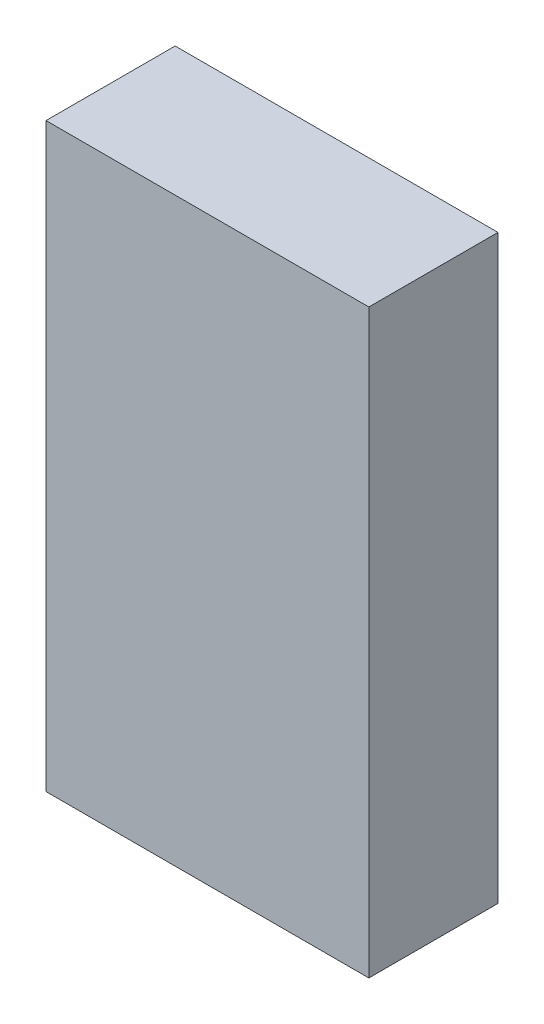
ISO-10303-21;
HEADER;
FILE_DESCRIPTION(('STEP AP214'),'2;1');
FILE_NAME('part.step','',(''),(''),'','','');
FILE_SCHEMA(('AUTOMOTIVE_DESIGN { 1 0 10303 214 1 1 1 1 }'));
ENDSEC;
DATA;
#1=APPLICATION_CONTEXT('core data for automotive mechanical design processes');
#2=APPLICATION_PROTOCOL_DEFINITION('international standard','automotive_design',2000,#1);
#3=PRODUCT_CONTEXT('',#1,'mechanical');
#4=PRODUCT('Part','Part','',(#3));
#5=PRODUCT_RELATED_PRODUCT_CATEGORY('part','',(#4));
#6=PRODUCT_DEFINITION_FORMATION('','',#4);
#7=PRODUCT_DEFINITION_CONTEXT('part definition',#1,'design');
#8=PRODUCT_DEFINITION('design','',#6,#7);
#9=PRODUCT_DEFINITION_SHAPE('','',#8);
#10=(LENGTH_UNIT() NAMED_UNIT(*) SI_UNIT(.MILLI.,.METRE.));
#11=(NAMED_UNIT(*) PLANE_ANGLE_UNIT() SI_UNIT($,.RADIAN.));
#12=(NAMED_UNIT(*) SI_UNIT($,.STERADIAN.) SOLID_ANGLE_UNIT());
#13=UNCERTAINTY_MEASURE_WITH_UNIT(LENGTH_MEASURE(1.E-05),#10,'distance_accuracy_value','');
#14=(GEOMETRIC_REPRESENTATION_CONTEXT(3) GLOBAL_UNCERTAINTY_ASSIGNED_CONTEXT((#13)) GLOBAL_UNIT_ASSIGNED_CONTEXT((#10,
#11,#12)) REPRESENTATION_CONTEXT('',''));
#15=CARTESIAN_POINT('',(0.,0.,0.));
#16=DIRECTION('',(0.,0.,1.));
#17=DIRECTION('',(1.,0.,0.));
#18=AXIS2_PLACEMENT_3D('',#15,#16,#17);
#19=CARTESIAN_POINT('',(0.875,-2.05,0.));
#20=DIRECTION('',(1.,0.,0.));
#21=DIRECTION('',(0.,0.,1.));
#22=AXIS2_PLACEMENT_3D('',#19,#20,#21);
#23=PLANE('',#22);
#24=DIRECTION('',(0.,1.,0.));
#25=VECTOR('',#24,1.);
#26=CARTESIAN_POINT('',(0.875,-2.05,0.1));
#27=LINE('',#26,#25);
#28=CARTESIAN_POINT('',(0.875,-2.05,0.1));
#29=VERTEX_POINT('',#28);
#30=CARTESIAN_POINT('',(0.875,-1.6,0.1));
#31=VERTEX_POINT('',#30);
#32=EDGE_CURVE('E11',#29,#31,#27,.T.);
#33=ORIENTED_EDGE('',*,*,#32,.T.);
#34=DIRECTION('',(0.,0.,1.));
#35=VECTOR('',#34,1.);
#36=CARTESIAN_POINT('',(0.875,-1.6,0.));
#37=LINE('',#36,#35);
#38=CARTESIAN_POINT('',(0.875,-1.6,0.));
#39=VERTEX_POINT('',#38);
#40=EDGE_CURVE('E24',#39,#31,#37,.T.);
#41=ORIENTED_EDGE('',*,*,#40,.F.);
#42=DIRECTION('',(0.,1.,0.));
#43=VECTOR('',#42,1.);
#44=CARTESIAN_POINT('',(0.875,-2.05,0.));
#45=LINE('',#44,#43);
#46=CARTESIAN_POINT('',(0.875,-2.05,0.));
#47=VERTEX_POINT('',#46);
#48=EDGE_CURVE('E86',#47,#39,#45,.T.);
#49=ORIENTED_EDGE('',*,*,#48,.F.);
#50=DIRECTION('',(0.,0.,1.));
#51=VECTOR('',#50,1.);
#52=CARTESIAN_POINT('',(0.875,-2.05,0.));
#53=LINE('',#52,#51);
#54=EDGE_CURVE('E36',#47,#29,#53,.T.);
#55=ORIENTED_EDGE('',*,*,#54,.T.);
#56=EDGE_LOOP('',(#33,#41,#49,#55));
#57=FACE_BOUND('',#56,.T.);
#58=ADVANCED_FACE('F17',(#57),#23,.F.);
#59=CARTESIAN_POINT('',(1.125,-2.05,0.));
#60=DIRECTION('',(1.,0.,0.));
#61=DIRECTION('',(0.,0.,1.));
#62=AXIS2_PLACEMENT_3D('',#59,#60,#61);
#63=PLANE('',#62);
#64=DIRECTION('',(0.,0.,1.));
#65=VECTOR('',#64,1.);
#66=CARTESIAN_POINT('',(1.125,-2.05,0.));
#67=LINE('',#66,#65);
#68=CARTESIAN_POINT('',(1.125,-2.05,0.));
#69=VERTEX_POINT('',#68);
#70=CARTESIAN_POINT('',(1.125,-2.05,0.1));
#71=VERTEX_POINT('',#70);
#72=EDGE_CURVE('E83',#69,#71,#67,.T.);
#73=ORIENTED_EDGE('',*,*,#72,.F.);
#74=DIRECTION('',(0.,1.,0.));
#75=VECTOR('',#74,1.);
#76=CARTESIAN_POINT('',(1.125,-2.05,0.));
#77=LINE('',#76,#75);
#78=CARTESIAN_POINT('',(1.125,-1.6,0.));
#79=VERTEX_POINT('',#78);
#80=EDGE_CURVE('E63',#69,#79,#77,.T.);
#81=ORIENTED_EDGE('',*,*,#80,.T.);
#82=DIRECTION('',(0.,0.,1.));
#83=VECTOR('',#82,1.);
#84=CARTESIAN_POINT('',(1.125,-1.6,0.));
#85=LINE('',#84,#83);
#86=CARTESIAN_POINT('',(1.125,-1.6,0.1));
#87=VERTEX_POINT('',#86);
#88=EDGE_CURVE('E57',#79,#87,#85,.T.);
#89=ORIENTED_EDGE('',*,*,#88,.T.);
#90=DIRECTION('',(0.,1.,0.));
#91=VECTOR('',#90,1.);
#92=CARTESIAN_POINT('',(1.125,-2.05,0.1));
#93=LINE('',#92,#91);
#94=EDGE_CURVE('E60',#71,#87,#93,.T.);
#95=ORIENTED_EDGE('',*,*,#94,.F.);
#96=EDGE_LOOP('',(#73,#81,#89,#95));
#97=FACE_BOUND('',#96,.T.);
#98=ADVANCED_FACE('F59',(#97),#63,.T.);
#99=CARTESIAN_POINT('',(0.875,-2.05,0.));
#100=DIRECTION('',(0.,1.,0.));
#101=DIRECTION('',(0.,0.,1.));
#102=AXIS2_PLACEMENT_3D('',#99,#100,#101);
#103=PLANE('',#102);
#104=ORIENTED_EDGE('',*,*,#72,.T.);
#105=DIRECTION('',(1.,0.,0.));
#106=VECTOR('',#105,1.);
#107=CARTESIAN_POINT('',(0.875,-2.05,0.1));
#108=LINE('',#107,#106);
#109=EDGE_CURVE('E71',#29,#71,#108,.T.);
#110=ORIENTED_EDGE('',*,*,#109,.F.);
#111=ORIENTED_EDGE('',*,*,#54,.F.);
#112=DIRECTION('',(1.,0.,0.));
#113=VECTOR('',#112,1.);
#114=CARTESIAN_POINT('',(0.875,-2.05,0.));
#115=LINE('',#114,#113);
#116=EDGE_CURVE('E76',#47,#69,#115,.T.);
#117=ORIENTED_EDGE('',*,*,#116,.T.);
#118=EDGE_LOOP('',(#104,#110,#111,#117));
#119=FACE_BOUND('',#118,.T.);
#120=ADVANCED_FACE('F91',(#119),#103,.F.);
#121=CARTESIAN_POINT('',(0.875,-1.6,0.));
#122=DIRECTION('',(0.,1.,0.));
#123=DIRECTION('',(0.,0.,1.));
#124=AXIS2_PLACEMENT_3D('',#121,#122,#123);
#125=PLANE('',#124);
#126=DIRECTION('',(1.,0.,0.));
#127=VECTOR('',#126,1.);
#128=CARTESIAN_POINT('',(0.875,-1.6,0.));
#129=LINE('',#128,#127);
#130=EDGE_CURVE('E74',#39,#79,#129,.T.);
#131=ORIENTED_EDGE('',*,*,#130,.F.);
#132=ORIENTED_EDGE('',*,*,#40,.T.);
#133=DIRECTION('',(1.,0.,0.));
#134=VECTOR('',#133,1.);
#135=CARTESIAN_POINT('',(0.875,-1.6,0.1));
#136=LINE('',#135,#134);
#137=EDGE_CURVE('E69',#31,#87,#136,.T.);
#138=ORIENTED_EDGE('',*,*,#137,.T.);
#139=ORIENTED_EDGE('',*,*,#88,.F.);
#140=EDGE_LOOP('',(#131,#132,#138,#139));
#141=FACE_BOUND('',#140,.T.);
#142=ADVANCED_FACE('F73',(#141),#125,.T.);
#143=CARTESIAN_POINT('',(0.875,-2.05,0.));
#144=DIRECTION('',(0.,0.,1.));
#145=DIRECTION('',(1.,0.,0.));
#146=AXIS2_PLACEMENT_3D('',#143,#144,#145);
#147=PLANE('',#146);
#148=ORIENTED_EDGE('',*,*,#130,.T.);
#149=ORIENTED_EDGE('',*,*,#80,.F.);
#150=ORIENTED_EDGE('',*,*,#116,.F.);
#151=ORIENTED_EDGE('',*,*,#48,.T.);
#152=EDGE_LOOP('',(#148,#149,#150,#151));
#153=FACE_BOUND('',#152,.T.);
#154=ADVANCED_FACE('F89',(#153),#147,.F.);
#155=CARTESIAN_POINT('',(0.875,-2.05,0.1));
#156=DIRECTION('',(0.,0.,1.));
#157=DIRECTION('',(1.,0.,0.));
#158=AXIS2_PLACEMENT_3D('',#155,#156,#157);
#159=PLANE('',#158);
#160=ORIENTED_EDGE('',*,*,#32,.F.);
#161=ORIENTED_EDGE('',*,*,#109,.T.);
#162=ORIENTED_EDGE('',*,*,#94,.T.);
#163=ORIENTED_EDGE('',*,*,#137,.F.);
#164=EDGE_LOOP('',(#160,#161,#162,#163));
#165=FACE_BOUND('',#164,.T.);
#166=ADVANCED_FACE('F68',(#165),#159,.T.);
#167=CLOSED_SHELL('',(#58,#98,#120,#142,#154,#166));
#168=MANIFOLD_SOLID_BREP('B1',#167);
#169=ADVANCED_BREP_SHAPE_REPRESENTATION('',(#18,#168),#14);
#170=SHAPE_DEFINITION_REPRESENTATION(#9,#169);
ENDSEC;
END-ISO-10303-21;
